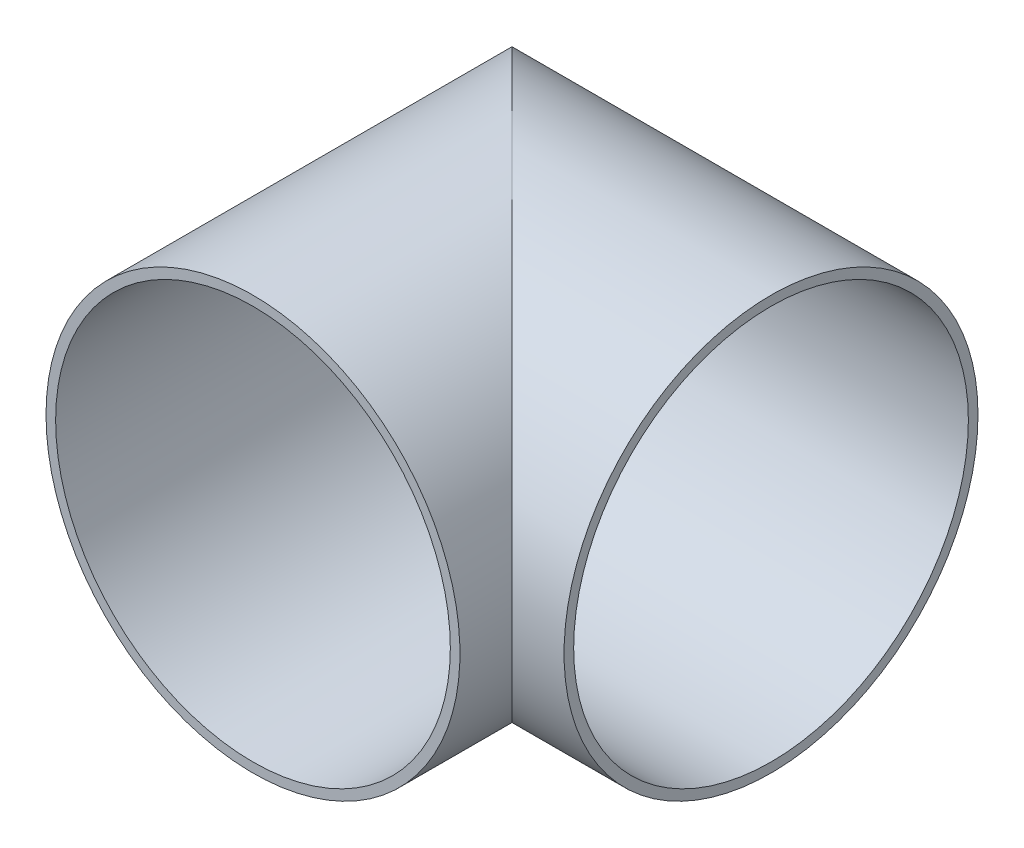
ISO-10303-21;
HEADER;
FILE_DESCRIPTION(('STEP AP214'),'2;1');
FILE_NAME('part.step','',(''),(''),'','','');
FILE_SCHEMA(('AUTOMOTIVE_DESIGN { 1 0 10303 214 1 1 1 1 }'));
ENDSEC;
DATA;
#1=APPLICATION_CONTEXT('core data for automotive mechanical design processes');
#2=APPLICATION_PROTOCOL_DEFINITION('international standard','automotive_design',2000,#1);
#3=PRODUCT_CONTEXT('',#1,'mechanical');
#4=PRODUCT('Part','Part','',(#3));
#5=PRODUCT_RELATED_PRODUCT_CATEGORY('part','',(#4));
#6=PRODUCT_DEFINITION_FORMATION('','',#4);
#7=PRODUCT_DEFINITION_CONTEXT('part definition',#1,'design');
#8=PRODUCT_DEFINITION('design','',#6,#7);
#9=PRODUCT_DEFINITION_SHAPE('','',#8);
#10=(LENGTH_UNIT() NAMED_UNIT(*) SI_UNIT(.MILLI.,.METRE.));
#11=(NAMED_UNIT(*) PLANE_ANGLE_UNIT() SI_UNIT($,.RADIAN.));
#12=(NAMED_UNIT(*) SI_UNIT($,.STERADIAN.) SOLID_ANGLE_UNIT());
#13=UNCERTAINTY_MEASURE_WITH_UNIT(LENGTH_MEASURE(1.E-05),#10,'distance_accuracy_value','');
#14=(GEOMETRIC_REPRESENTATION_CONTEXT(3) GLOBAL_UNCERTAINTY_ASSIGNED_CONTEXT((#13)) GLOBAL_UNIT_ASSIGNED_CONTEXT((#10,
#11,#12)) REPRESENTATION_CONTEXT('',''));
#15=CARTESIAN_POINT('',(0.,0.,0.));
#16=DIRECTION('',(0.,0.,1.));
#17=DIRECTION('',(1.,0.,0.));
#18=AXIS2_PLACEMENT_3D('',#15,#16,#17);
#19=CARTESIAN_POINT('',(-29.4032489859079,0.,-8.93210700324507));
#20=DIRECTION('',(1.,0.,0.));
#21=DIRECTION('',(0.,0.,-1.));
#22=AXIS2_PLACEMENT_3D('',#19,#20,#21);
#23=CYLINDRICAL_SURFACE('',#22,26.6393172599163);
#24=CARTESIAN_POINT('',(0.,0.,-8.93210700324507));
#25=DIRECTION('',(0.707106781186548,0.,-0.707106781186548));
#26=DIRECTION('',(-0.707106781186548,0.,-0.707106781186548));
#27=AXIS2_PLACEMENT_3D('',#24,#25,#26);
#28=ELLIPSE('',#27,37.6736837613333,26.6393172599163);
#29=CARTESIAN_POINT('',(-26.6393172599163,0.,-35.5714242631613));
#30=VERTEX_POINT('',#29);
#31=EDGE_CURVE('E36',#30,#30,#28,.F.);
#32=ORIENTED_EDGE('',*,*,#31,.F.);
#33=EDGE_LOOP('',(#32));
#34=FACE_BOUND('',#33,.T.);
#35=CARTESIAN_POINT('',(33.3375,0.,-8.93210700324507));
#36=DIRECTION('',(1.,0.,0.));
#37=DIRECTION('',(0.,0.,-1.));
#38=AXIS2_PLACEMENT_3D('',#35,#36,#37);
#39=CIRCLE('',#38,26.6393172599163);
#40=CARTESIAN_POINT('',(33.3375,0.,-35.5714242631613));
#41=VERTEX_POINT('',#40);
#42=EDGE_CURVE('E47',#41,#41,#39,.T.);
#43=ORIENTED_EDGE('',*,*,#42,.F.);
#44=EDGE_LOOP('',(#43));
#45=FACE_BOUND('',#44,.T.);
#46=ADVANCED_FACE('F33',(#34,#45),#23,.T.);
#47=CARTESIAN_POINT('',(0.,0.,24.4053929967549));
#48=DIRECTION('',(0.,0.,-1.));
#49=DIRECTION('',(-1.,0.,0.));
#50=AXIS2_PLACEMENT_3D('',#47,#48,#49);
#51=CYLINDRICAL_SURFACE('',#50,26.6393172599163);
#52=CARTESIAN_POINT('',(0.,0.,24.4053929967549));
#53=DIRECTION('',(0.,0.,-1.));
#54=DIRECTION('',(-1.,0.,0.));
#55=AXIS2_PLACEMENT_3D('',#52,#53,#54);
#56=CIRCLE('',#55,26.6393172599163);
#57=CARTESIAN_POINT('',(-26.6393172599163,0.,24.4053929967549));
#58=VERTEX_POINT('',#57);
#59=EDGE_CURVE('E53',#58,#58,#56,.T.);
#60=ORIENTED_EDGE('',*,*,#59,.T.);
#61=EDGE_LOOP('',(#60));
#62=FACE_BOUND('',#61,.T.);
#63=ORIENTED_EDGE('',*,*,#31,.T.);
#64=EDGE_LOOP('',(#63));
#65=FACE_BOUND('',#64,.T.);
#66=ADVANCED_FACE('F78',(#62,#65),#51,.T.);
#67=CARTESIAN_POINT('',(33.3375,0.,-8.93210700324507));
#68=DIRECTION('',(1.,0.,0.));
#69=DIRECTION('',(0.,0.,-1.));
#70=AXIS2_PLACEMENT_3D('',#67,#68,#69);
#71=PLANE('',#70);
#72=CARTESIAN_POINT('',(33.3375,0.,-8.93210700324507));
#73=DIRECTION('',(1.,0.,0.));
#74=DIRECTION('',(0.,0.,-1.));
#75=AXIS2_PLACEMENT_3D('',#72,#73,#74);
#76=CIRCLE('',#75,25.4);
#77=CARTESIAN_POINT('',(33.3375,0.,-34.3321070032451));
#78=VERTEX_POINT('',#77);
#79=EDGE_CURVE('E72',#78,#78,#76,.F.);
#80=ORIENTED_EDGE('',*,*,#79,.T.);
#81=EDGE_LOOP('',(#80));
#82=FACE_BOUND('',#81,.T.);
#83=ORIENTED_EDGE('',*,*,#42,.T.);
#84=EDGE_LOOP('',(#83));
#85=FACE_BOUND('',#84,.T.);
#86=ADVANCED_FACE('F80',(#82,#85),#71,.T.);
#87=CARTESIAN_POINT('',(0.,0.,24.4053929967549));
#88=DIRECTION('',(0.,0.,-1.));
#89=DIRECTION('',(-1.,0.,0.));
#90=AXIS2_PLACEMENT_3D('',#87,#88,#89);
#91=PLANE('',#90);
#92=CARTESIAN_POINT('',(0.,0.,24.4053929967549));
#93=DIRECTION('',(0.,0.,-1.));
#94=DIRECTION('',(-1.,0.,0.));
#95=AXIS2_PLACEMENT_3D('',#92,#93,#94);
#96=CIRCLE('',#95,25.4);
#97=CARTESIAN_POINT('',(-25.4,0.,24.4053929967549));
#98=VERTEX_POINT('',#97);
#99=EDGE_CURVE('E41',#98,#98,#96,.F.);
#100=ORIENTED_EDGE('',*,*,#99,.F.);
#101=EDGE_LOOP('',(#100));
#102=FACE_BOUND('',#101,.T.);
#103=ORIENTED_EDGE('',*,*,#59,.F.);
#104=EDGE_LOOP('',(#103));
#105=FACE_BOUND('',#104,.T.);
#106=ADVANCED_FACE('F69',(#102,#105),#91,.F.);
#107=CARTESIAN_POINT('',(-28.04,0.,-8.93210700324507));
#108=DIRECTION('',(1.,0.,0.));
#109=DIRECTION('',(0.,0.,-1.));
#110=AXIS2_PLACEMENT_3D('',#107,#108,#109);
#111=CYLINDRICAL_SURFACE('',#110,25.4);
#112=CARTESIAN_POINT('',(0.,0.,-8.93210700324507));
#113=DIRECTION('',(0.707106781186547,0.,-0.707106781186547));
#114=DIRECTION('',(-0.707106781186548,0.,-0.707106781186548));
#115=AXIS2_PLACEMENT_3D('',#112,#113,#114);
#116=ELLIPSE('',#115,35.9210244842766,25.4);
#117=CARTESIAN_POINT('',(-25.4,0.,-34.3321070032451));
#118=VERTEX_POINT('',#117);
#119=EDGE_CURVE('E11',#118,#118,#116,.T.);
#120=ORIENTED_EDGE('',*,*,#119,.F.);
#121=EDGE_LOOP('',(#120));
#122=FACE_BOUND('',#121,.T.);
#123=ORIENTED_EDGE('',*,*,#79,.F.);
#124=EDGE_LOOP('',(#123));
#125=FACE_BOUND('',#124,.T.);
#126=ADVANCED_FACE('F89',(#122,#125),#111,.F.);
#127=CARTESIAN_POINT('',(0.,0.,24.4053929967549));
#128=DIRECTION('',(0.,0.,-1.));
#129=DIRECTION('',(-1.,0.,0.));
#130=AXIS2_PLACEMENT_3D('',#127,#128,#129);
#131=CYLINDRICAL_SURFACE('',#130,25.4);
#132=ORIENTED_EDGE('',*,*,#99,.T.);
#133=EDGE_LOOP('',(#132));
#134=FACE_BOUND('',#133,.T.);
#135=ORIENTED_EDGE('',*,*,#119,.T.);
#136=EDGE_LOOP('',(#135));
#137=FACE_BOUND('',#136,.T.);
#138=ADVANCED_FACE('F87',(#134,#137),#131,.F.);
#139=CLOSED_SHELL('',(#46,#66,#86,#106,#126,#138));
#140=MANIFOLD_SOLID_BREP('B2',#139);
#141=ADVANCED_BREP_SHAPE_REPRESENTATION('',(#18,#140),#14);
#142=SHAPE_DEFINITION_REPRESENTATION(#9,#141);
ENDSEC;
END-ISO-10303-21;
